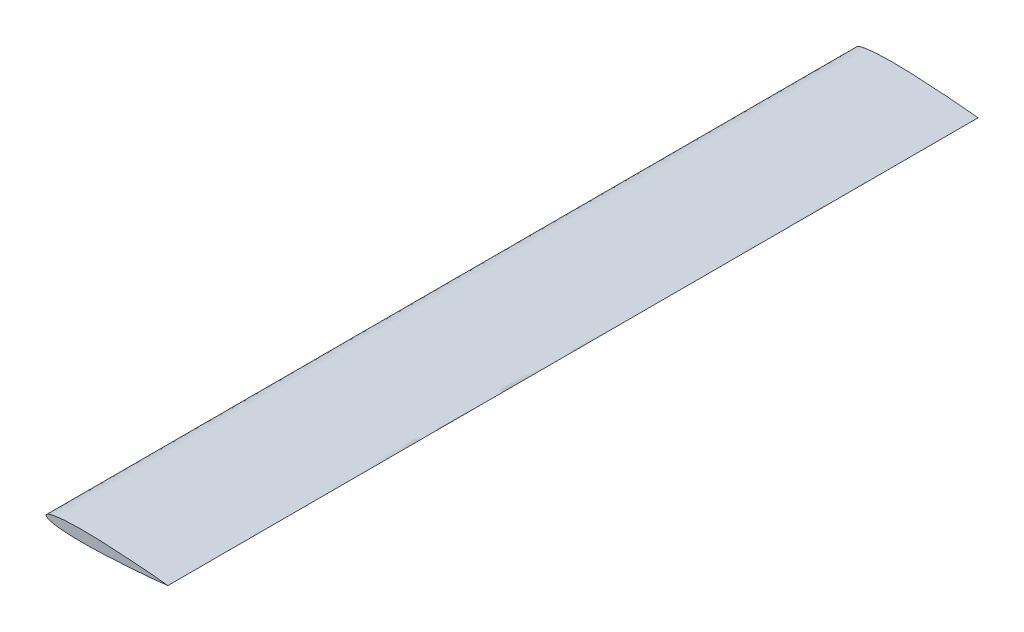
ISO-10303-21;
HEADER;
FILE_DESCRIPTION(('STEP AP214'),'2;1');
FILE_NAME('part.step','',(''),(''),'','','');
FILE_SCHEMA(('AUTOMOTIVE_DESIGN { 1 0 10303 214 1 1 1 1 }'));
ENDSEC;
DATA;
#1=APPLICATION_CONTEXT('core data for automotive mechanical design processes');
#2=APPLICATION_PROTOCOL_DEFINITION('international standard','automotive_design',2000,#1);
#3=PRODUCT_CONTEXT('',#1,'mechanical');
#4=PRODUCT('Part','Part','',(#3));
#5=PRODUCT_RELATED_PRODUCT_CATEGORY('part','',(#4));
#6=PRODUCT_DEFINITION_FORMATION('','',#4);
#7=PRODUCT_DEFINITION_CONTEXT('part definition',#1,'design');
#8=PRODUCT_DEFINITION('design','',#6,#7);
#9=PRODUCT_DEFINITION_SHAPE('','',#8);
#10=(LENGTH_UNIT() NAMED_UNIT(*) SI_UNIT(.MILLI.,.METRE.));
#11=(NAMED_UNIT(*) PLANE_ANGLE_UNIT() SI_UNIT($,.RADIAN.));
#12=(NAMED_UNIT(*) SI_UNIT($,.STERADIAN.) SOLID_ANGLE_UNIT());
#13=UNCERTAINTY_MEASURE_WITH_UNIT(LENGTH_MEASURE(1.E-05),#10,'distance_accuracy_value','');
#14=(GEOMETRIC_REPRESENTATION_CONTEXT(3) GLOBAL_UNCERTAINTY_ASSIGNED_CONTEXT((#13)) GLOBAL_UNIT_ASSIGNED_CONTEXT((#10,
#11,#12)) REPRESENTATION_CONTEXT('',''));
#15=CARTESIAN_POINT('',(0.,0.,0.));
#16=DIRECTION('',(0.,0.,1.));
#17=DIRECTION('',(1.,0.,0.));
#18=AXIS2_PLACEMENT_3D('',#15,#16,#17);
#19=CARTESIAN_POINT('',(200.,0.,1330.));
#20=CARTESIAN_POINT('',(200.,0.0382081789382283,1330.));
#21=CARTESIAN_POINT('',(198.17304904431,0.190225049855714,1330.));
#22=CARTESIAN_POINT('',(196.299321827907,0.507442706254723,1330.));
#23=CARTESIAN_POINT('',(191.747902409713,0.993763140540347,1330.));
#24=CARTESIAN_POINT('',(186.15583551062,1.59742483887089,1330.));
#25=CARTESIAN_POINT('',(178.869410335489,2.30581672072034,1330.));
#26=CARTESIAN_POINT('',(170.31474626905,3.08757355077791,1330.));
#27=CARTESIAN_POINT('',(160.529272093653,3.92759907002483,1330.));
#28=CARTESIAN_POINT('',(149.717754924415,4.80131235923475,1330.));
#29=CARTESIAN_POINT('',(138.052566354673,5.67381446541815,1330.));
#30=CARTESIAN_POINT('',(125.737106614075,6.5192525876967,1330.));
#31=CARTESIAN_POINT('',(112.981210062335,7.29872388413823,1330.));
#32=CARTESIAN_POINT('',(100.003286779257,7.97921904733727,1330.));
#33=CARTESIAN_POINT('',(87.0249277535441,8.52028632172407,1330.));
#34=CARTESIAN_POINT('',(76.3086521254569,8.83285185574405,1330.));
#35=CARTESIAN_POINT('',(67.9023437895598,8.97644226723843,1330.));
#36=CARTESIAN_POINT('',(61.7867743061123,9.02740184163897,1330.));
#37=CARTESIAN_POINT('',(55.8344160189546,9.0202834113506,1330.));
#38=CARTESIAN_POINT('',(50.0707275159979,8.943660593386,1330.));
#39=CARTESIAN_POINT('',(44.5208388481526,8.80916209633754,1330.));
#40=CARTESIAN_POINT('',(39.2089744336134,8.6060402435244,1330.));
#41=CARTESIAN_POINT('',(34.1574590264249,8.34169117101135,1330.));
#42=CARTESIAN_POINT('',(29.3872557912349,8.00995266432045,1330.));
#43=CARTESIAN_POINT('',(24.9185915320316,7.6164380254828,1330.));
#44=CARTESIAN_POINT('',(20.7720459522843,7.15770178176542,1330.));
#45=CARTESIAN_POINT('',(16.9649026364116,6.64248930510332,1330.));
#46=CARTESIAN_POINT('',(13.5120476934643,6.08408238005927,1330.));
#47=CARTESIAN_POINT('',(10.4278612724919,5.48498209465953,1330.));
#48=CARTESIAN_POINT('',(7.72236247681685,4.84726467704815,1330.));
#49=CARTESIAN_POINT('',(5.40836345531859,4.14945370834077,1330.));
#50=CARTESIAN_POINT('',(3.49088680786182,3.378624358705,1330.));
#51=CARTESIAN_POINT('',(1.98747725777448,2.52812023699052,1330.));
#52=CARTESIAN_POINT('',(0.906342382598221,1.64000623579424,1330.));
#53=CARTESIAN_POINT('',(0.231166118930239,0.826014489325518,1330.));
#54=CARTESIAN_POINT('',(-0.0945931385274746,0.,1330.));
#55=CARTESIAN_POINT('',(0.231166118930244,-0.826014489325538,1330.));
#56=CARTESIAN_POINT('',(0.906342382598231,-1.64000623579424,1330.));
#57=CARTESIAN_POINT('',(1.98747725777446,-2.5281202369905,1330.));
#58=CARTESIAN_POINT('',(3.49088680786185,-3.37862435870502,1330.));
#59=CARTESIAN_POINT('',(5.40836345531857,-4.14945370834076,1330.));
#60=CARTESIAN_POINT('',(7.72236247681685,-4.84726467704816,1330.));
#61=CARTESIAN_POINT('',(10.4278612724919,-5.48498209465952,1330.));
#62=CARTESIAN_POINT('',(13.5120476934643,-6.08408238005928,1330.));
#63=CARTESIAN_POINT('',(16.9649026364116,-6.64248930510331,1330.));
#64=CARTESIAN_POINT('',(20.7720459522843,-7.15770178176542,1330.));
#65=CARTESIAN_POINT('',(24.9185915320316,-7.6164380254828,1330.));
#66=CARTESIAN_POINT('',(29.3872557912349,-8.00995266432045,1330.));
#67=CARTESIAN_POINT('',(34.1574590264249,-8.34169117101135,1330.));
#68=CARTESIAN_POINT('',(39.2089744336134,-8.6060402435244,1330.));
#69=CARTESIAN_POINT('',(44.5208388481527,-8.80916209633753,1330.));
#70=CARTESIAN_POINT('',(50.0707275159979,-8.94366059338599,1330.));
#71=CARTESIAN_POINT('',(55.8344160189547,-9.0202834113506,1330.));
#72=CARTESIAN_POINT('',(61.7867743061123,-9.02740184163897,1330.));
#73=CARTESIAN_POINT('',(67.9023437895597,-8.97644226723844,1330.));
#74=CARTESIAN_POINT('',(76.308652125457,-8.83285185574405,1330.));
#75=CARTESIAN_POINT('',(87.024927753544,-8.52028632172406,1330.));
#76=CARTESIAN_POINT('',(100.003286779257,-7.97921904733727,1330.));
#77=CARTESIAN_POINT('',(112.981210062335,-7.29872388413822,1330.));
#78=CARTESIAN_POINT('',(125.737106614075,-6.5192525876967,1330.));
#79=CARTESIAN_POINT('',(138.052566354673,-5.67381446541815,1330.));
#80=CARTESIAN_POINT('',(149.717754924415,-4.80131235923475,1330.));
#81=CARTESIAN_POINT('',(160.529272093653,-3.92759907002483,1330.));
#82=CARTESIAN_POINT('',(170.31474626905,-3.08757355077791,1330.));
#83=CARTESIAN_POINT('',(178.869410335489,-2.30581672072034,1330.));
#84=CARTESIAN_POINT('',(186.15583551062,-1.59742483887089,1330.));
#85=CARTESIAN_POINT('',(191.747902409713,-0.993763140540349,1330.));
#86=CARTESIAN_POINT('',(196.299321827907,-0.507442706254724,1330.));
#87=CARTESIAN_POINT('',(198.17304904431,-0.190225049855715,1330.));
#88=CARTESIAN_POINT('',(200.,-0.0382081789382284,1330.));
#89=CARTESIAN_POINT('',(200.,0.,1330.));
#90=B_SPLINE_CURVE_WITH_KNOTS('',3,(#19,#20,#21,#22,#23,#24,#25,#26,#27,#28,#29,#30,#31,#32,#33,
#34,#35,#36,#37,#38,#39,#40,#41,#42,#43,#44,#45,#46,#47,#48,#49,#50,#51,#52,#53,#54,#55,#56,#57,
#58,#59,#60,#61,#62,#63,#64,#65,#66,#67,#68,#69,#70,#71,#72,#73,#74,#75,#76,#77,#78,#79,#80,#81,
#82,#83,#84,#85,#86,#87,#88,#89),.UNSPECIFIED.,.T.,.F.,(4,1,1,1,1,1,1,1,1,1,1,1,1,1,1,1,1,1,1,1,
1,1,1,1,1,1,1,1,1,1,1,1,1,1,1,1,1,1,1,1,1,1,1,1,1,1,1,1,1,1,1,1,1,1,1,1,1,1,1,1,1,1,1,1,1,1,1,1,
4),(0.,0.0021334274953682,0.00848815570874328,0.0189444871418497,0.0333191137755611,
0.0513562940971698,0.0727560928984786,0.0971408174352606,0.124097488782512,0.153162556777752,
0.183833917661664,0.21558937445911,0.247878194577005,0.280150867864074,0.311860397032406,
0.327332942728477,0.342462846119516,0.35718710244681,0.371448118351621,0.385183441042633,
0.398331272584713,0.410844637191414,0.422672607167312,0.433769314473499,0.444090175228778,
0.453589411782157,0.462240439844477,0.470010037325291,0.476870984677,0.482833353063501,
0.487908551351284,0.492155163583175,0.495592273393841,0.498196358984712,0.5,0.501803641015288,
0.504407726606159,0.507844836416825,0.512091448648716,0.517166646936499,0.523129015323001,
0.529989962674709,0.537759560155523,0.546410588217844,0.555909824771222,0.566230685526501,
0.577327392832688,0.589155362808586,0.601668727415287,0.614816558957367,0.62855188164838,
0.64281289755319,0.657537153880484,0.672667057271523,0.688139602967594,0.719849132135926,
0.752121805422996,0.78441062554089,0.816166082338336,0.846837443222248,0.875902511217488,
0.90285918256474,0.927243907101521,0.94864370590283,0.966680886224439,0.98105551285815,
0.991511844291257,0.997866572504632,1.),.UNSPECIFIED.);
#91=DIRECTION('',(0.,0.,-1.));
#92=VECTOR('',#91,1.);
#93=SURFACE_OF_LINEAR_EXTRUSION('',#90,#92);
#94=CARTESIAN_POINT('',(200.,0.,1330.));
#95=VERTEX_POINT('',#94);
#96=EDGE_CURVE('E10',#95,#95,#90,.T.);
#97=ORIENTED_EDGE('',*,*,#96,.F.);
#98=EDGE_LOOP('',(#97));
#99=FACE_BOUND('',#98,.T.);
#100=CARTESIAN_POINT('',(200.,0.,0.));
#101=CARTESIAN_POINT('',(200.,0.0382081789382283,0.));
#102=CARTESIAN_POINT('',(198.17304904431,0.190225049855714,0.));
#103=CARTESIAN_POINT('',(196.299321827907,0.507442706254723,0.));
#104=CARTESIAN_POINT('',(191.747902409713,0.993763140540347,0.));
#105=CARTESIAN_POINT('',(186.15583551062,1.59742483887089,0.));
#106=CARTESIAN_POINT('',(178.869410335489,2.30581672072034,0.));
#107=CARTESIAN_POINT('',(170.31474626905,3.08757355077791,0.));
#108=CARTESIAN_POINT('',(160.529272093653,3.92759907002483,0.));
#109=CARTESIAN_POINT('',(149.717754924415,4.80131235923475,0.));
#110=CARTESIAN_POINT('',(138.052566354673,5.67381446541815,0.));
#111=CARTESIAN_POINT('',(125.737106614075,6.5192525876967,0.));
#112=CARTESIAN_POINT('',(112.981210062335,7.29872388413823,0.));
#113=CARTESIAN_POINT('',(100.003286779257,7.97921904733727,0.));
#114=CARTESIAN_POINT('',(87.0249277535441,8.52028632172407,0.));
#115=CARTESIAN_POINT('',(76.3086521254569,8.83285185574405,0.));
#116=CARTESIAN_POINT('',(67.9023437895598,8.97644226723843,0.));
#117=CARTESIAN_POINT('',(61.7867743061123,9.02740184163897,0.));
#118=CARTESIAN_POINT('',(55.8344160189546,9.0202834113506,0.));
#119=CARTESIAN_POINT('',(50.0707275159979,8.943660593386,0.));
#120=CARTESIAN_POINT('',(44.5208388481526,8.80916209633754,0.));
#121=CARTESIAN_POINT('',(39.2089744336134,8.6060402435244,0.));
#122=CARTESIAN_POINT('',(34.1574590264249,8.34169117101135,0.));
#123=CARTESIAN_POINT('',(29.3872557912349,8.00995266432045,0.));
#124=CARTESIAN_POINT('',(24.9185915320316,7.6164380254828,0.));
#125=CARTESIAN_POINT('',(20.7720459522843,7.15770178176542,0.));
#126=CARTESIAN_POINT('',(16.9649026364116,6.64248930510332,0.));
#127=CARTESIAN_POINT('',(13.5120476934643,6.08408238005927,0.));
#128=CARTESIAN_POINT('',(10.4278612724919,5.48498209465953,0.));
#129=CARTESIAN_POINT('',(7.72236247681685,4.84726467704815,0.));
#130=CARTESIAN_POINT('',(5.40836345531859,4.14945370834077,0.));
#131=CARTESIAN_POINT('',(3.49088680786182,3.378624358705,0.));
#132=CARTESIAN_POINT('',(1.98747725777448,2.52812023699052,0.));
#133=CARTESIAN_POINT('',(0.906342382598221,1.64000623579424,0.));
#134=CARTESIAN_POINT('',(0.231166118930239,0.826014489325518,0.));
#135=CARTESIAN_POINT('',(-0.0945931385274746,0.,0.));
#136=CARTESIAN_POINT('',(0.231166118930244,-0.826014489325538,0.));
#137=CARTESIAN_POINT('',(0.906342382598231,-1.64000623579424,0.));
#138=CARTESIAN_POINT('',(1.98747725777446,-2.5281202369905,0.));
#139=CARTESIAN_POINT('',(3.49088680786185,-3.37862435870502,0.));
#140=CARTESIAN_POINT('',(5.40836345531857,-4.14945370834076,0.));
#141=CARTESIAN_POINT('',(7.72236247681685,-4.84726467704816,0.));
#142=CARTESIAN_POINT('',(10.4278612724919,-5.48498209465952,0.));
#143=CARTESIAN_POINT('',(13.5120476934643,-6.08408238005928,0.));
#144=CARTESIAN_POINT('',(16.9649026364116,-6.64248930510331,0.));
#145=CARTESIAN_POINT('',(20.7720459522843,-7.15770178176542,0.));
#146=CARTESIAN_POINT('',(24.9185915320316,-7.6164380254828,0.));
#147=CARTESIAN_POINT('',(29.3872557912349,-8.00995266432045,0.));
#148=CARTESIAN_POINT('',(34.1574590264249,-8.34169117101135,0.));
#149=CARTESIAN_POINT('',(39.2089744336134,-8.6060402435244,0.));
#150=CARTESIAN_POINT('',(44.5208388481527,-8.80916209633753,0.));
#151=CARTESIAN_POINT('',(50.0707275159979,-8.94366059338599,0.));
#152=CARTESIAN_POINT('',(55.8344160189547,-9.0202834113506,0.));
#153=CARTESIAN_POINT('',(61.7867743061123,-9.02740184163897,0.));
#154=CARTESIAN_POINT('',(67.9023437895597,-8.97644226723844,0.));
#155=CARTESIAN_POINT('',(76.308652125457,-8.83285185574405,0.));
#156=CARTESIAN_POINT('',(87.024927753544,-8.52028632172406,0.));
#157=CARTESIAN_POINT('',(100.003286779257,-7.97921904733727,0.));
#158=CARTESIAN_POINT('',(112.981210062335,-7.29872388413822,0.));
#159=CARTESIAN_POINT('',(125.737106614075,-6.5192525876967,0.));
#160=CARTESIAN_POINT('',(138.052566354673,-5.67381446541815,0.));
#161=CARTESIAN_POINT('',(149.717754924415,-4.80131235923475,0.));
#162=CARTESIAN_POINT('',(160.529272093653,-3.92759907002483,0.));
#163=CARTESIAN_POINT('',(170.31474626905,-3.08757355077791,0.));
#164=CARTESIAN_POINT('',(178.869410335489,-2.30581672072034,0.));
#165=CARTESIAN_POINT('',(186.15583551062,-1.59742483887089,0.));
#166=CARTESIAN_POINT('',(191.747902409713,-0.993763140540349,0.));
#167=CARTESIAN_POINT('',(196.299321827907,-0.507442706254724,0.));
#168=CARTESIAN_POINT('',(198.17304904431,-0.190225049855715,0.));
#169=CARTESIAN_POINT('',(200.,-0.0382081789382284,0.));
#170=CARTESIAN_POINT('',(200.,0.,0.));
#171=B_SPLINE_CURVE_WITH_KNOTS('',3,(#100,#101,#102,#103,#104,#105,#106,#107,#108,#109,#110,
#111,#112,#113,#114,#115,#116,#117,#118,#119,#120,#121,#122,#123,#124,#125,#126,#127,#128,#129,
#130,#131,#132,#133,#134,#135,#136,#137,#138,#139,#140,#141,#142,#143,#144,#145,#146,#147,#148,
#149,#150,#151,#152,#153,#154,#155,#156,#157,#158,#159,#160,#161,#162,#163,#164,#165,#166,#167,
#168,#169,#170),.UNSPECIFIED.,.T.,.F.,(4,1,1,1,1,1,1,1,1,1,1,1,1,1,1,1,1,1,1,1,1,1,1,1,1,1,1,1,
1,1,1,1,1,1,1,1,1,1,1,1,1,1,1,1,1,1,1,1,1,1,1,1,1,1,1,1,1,1,1,1,1,1,1,1,1,1,1,1,4),(0.,
0.0021334274953682,0.00848815570874328,0.0189444871418497,0.0333191137755611,0.0513562940971698,
0.0727560928984786,0.0971408174352606,0.124097488782512,0.153162556777752,0.183833917661664,
0.21558937445911,0.247878194577005,0.280150867864074,0.311860397032406,0.327332942728477,
0.342462846119516,0.35718710244681,0.371448118351621,0.385183441042633,0.398331272584713,
0.410844637191414,0.422672607167312,0.433769314473499,0.444090175228778,0.453589411782157,
0.462240439844477,0.470010037325291,0.476870984677,0.482833353063501,0.487908551351284,
0.492155163583175,0.495592273393841,0.498196358984712,0.5,0.501803641015288,0.504407726606159,
0.507844836416825,0.512091448648716,0.517166646936499,0.523129015323001,0.529989962674709,
0.537759560155523,0.546410588217844,0.555909824771222,0.566230685526501,0.577327392832688,
0.589155362808586,0.601668727415287,0.614816558957367,0.62855188164838,0.64281289755319,
0.657537153880484,0.672667057271523,0.688139602967594,0.719849132135926,0.752121805422996,
0.78441062554089,0.816166082338336,0.846837443222248,0.875902511217488,0.90285918256474,
0.927243907101521,0.94864370590283,0.966680886224439,0.98105551285815,0.991511844291257,
0.997866572504632,1.),.UNSPECIFIED.);
#172=CARTESIAN_POINT('',(200.,0.,0.));
#173=VERTEX_POINT('',#172);
#174=EDGE_CURVE('E34',#173,#173,#171,.T.);
#175=ORIENTED_EDGE('',*,*,#174,.T.);
#176=EDGE_LOOP('',(#175));
#177=FACE_BOUND('',#176,.T.);
#178=ADVANCED_FACE('F30',(#99,#177),#93,.F.);
#179=CARTESIAN_POINT('',(0.,0.,1330.));
#180=DIRECTION('',(0.,0.,-1.));
#181=DIRECTION('',(-1.,0.,0.));
#182=AXIS2_PLACEMENT_3D('',#179,#180,#181);
#183=PLANE('',#182);
#184=ORIENTED_EDGE('',*,*,#96,.T.);
#185=EDGE_LOOP('',(#184));
#186=FACE_BOUND('',#185,.T.);
#187=ADVANCED_FACE('F53',(#186),#183,.F.);
#188=CARTESIAN_POINT('',(0.,0.,0.));
#189=DIRECTION('',(0.,0.,-1.));
#190=DIRECTION('',(-1.,0.,0.));
#191=AXIS2_PLACEMENT_3D('',#188,#189,#190);
#192=PLANE('',#191);
#193=ORIENTED_EDGE('',*,*,#174,.F.);
#194=EDGE_LOOP('',(#193));
#195=FACE_BOUND('',#194,.T.);
#196=ADVANCED_FACE('F51',(#195),#192,.T.);
#197=CLOSED_SHELL('',(#178,#187,#196));
#198=MANIFOLD_SOLID_BREP('B2',#197);
#199=ADVANCED_BREP_SHAPE_REPRESENTATION('',(#18,#198),#14);
#200=SHAPE_DEFINITION_REPRESENTATION(#9,#199);
ENDSEC;
END-ISO-10303-21;
